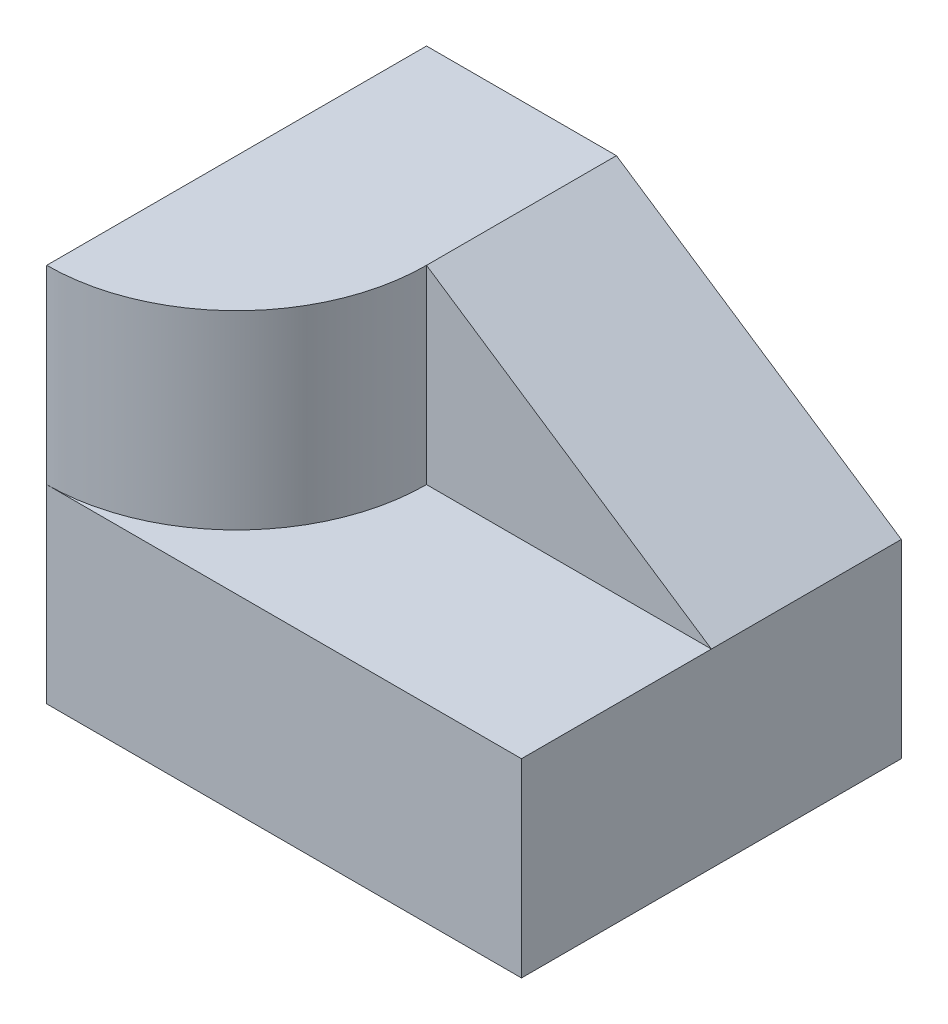
ISO-10303-21;
HEADER;
FILE_DESCRIPTION(('STEP AP214'),'2;1');
FILE_NAME('part.step','',(''),(''),'','','');
FILE_SCHEMA(('AUTOMOTIVE_DESIGN { 1 0 10303 214 1 1 1 1 }'));
ENDSEC;
DATA;
#1=APPLICATION_CONTEXT('core data for automotive mechanical design processes');
#2=APPLICATION_PROTOCOL_DEFINITION('international standard','automotive_design',2000,#1);
#3=PRODUCT_CONTEXT('',#1,'mechanical');
#4=PRODUCT('Part','Part','',(#3));
#5=PRODUCT_RELATED_PRODUCT_CATEGORY('part','',(#4));
#6=PRODUCT_DEFINITION_FORMATION('','',#4);
#7=PRODUCT_DEFINITION_CONTEXT('part definition',#1,'design');
#8=PRODUCT_DEFINITION('design','',#6,#7);
#9=PRODUCT_DEFINITION_SHAPE('','',#8);
#10=(LENGTH_UNIT() NAMED_UNIT(*) SI_UNIT(.MILLI.,.METRE.));
#11=(NAMED_UNIT(*) PLANE_ANGLE_UNIT() SI_UNIT($,.RADIAN.));
#12=(NAMED_UNIT(*) SI_UNIT($,.STERADIAN.) SOLID_ANGLE_UNIT());
#13=UNCERTAINTY_MEASURE_WITH_UNIT(LENGTH_MEASURE(1.E-05),#10,'distance_accuracy_value','');
#14=(GEOMETRIC_REPRESENTATION_CONTEXT(3) GLOBAL_UNCERTAINTY_ASSIGNED_CONTEXT((#13)) GLOBAL_UNIT_ASSIGNED_CONTEXT((#10,
#11,#12)) REPRESENTATION_CONTEXT('',''));
#15=CARTESIAN_POINT('',(0.,0.,0.));
#16=DIRECTION('',(0.,0.,1.));
#17=DIRECTION('',(1.,0.,0.));
#18=AXIS2_PLACEMENT_3D('',#15,#16,#17);
#19=CARTESIAN_POINT('',(-3.7855743992883,8.55901345742366,-0.575063618321078));
#20=DIRECTION('',(-1.,0.,0.));
#21=DIRECTION('',(0.,0.,1.));
#22=AXIS2_PLACEMENT_3D('',#19,#20,#21);
#23=PLANE('',#22);
#24=DIRECTION('',(0.,0.,-1.));
#25=VECTOR('',#24,1.);
#26=CARTESIAN_POINT('',(-3.7855743992883,6.55901345742366,-0.575063618321078));
#27=LINE('',#26,#25);
#28=CARTESIAN_POINT('',(-3.7855743992883,6.55901345742366,1.42493638167892));
#29=VERTEX_POINT('',#28);
#30=CARTESIAN_POINT('',(-3.7855743992883,6.55901345742366,-2.57506361832108));
#31=VERTEX_POINT('',#30);
#32=EDGE_CURVE('E103',#29,#31,#27,.T.);
#33=ORIENTED_EDGE('',*,*,#32,.F.);
#34=DIRECTION('',(0.,-1.,0.));
#35=VECTOR('',#34,1.);
#36=CARTESIAN_POINT('',(-3.7855743992883,8.55901345742366,1.42493638167892));
#37=LINE('',#36,#35);
#38=CARTESIAN_POINT('',(-3.7855743992883,8.55901345742366,1.42493638167892));
#39=VERTEX_POINT('',#38);
#40=EDGE_CURVE('E45',#39,#29,#37,.T.);
#41=ORIENTED_EDGE('',*,*,#40,.F.);
#42=DIRECTION('',(0.,-1.,0.));
#43=VECTOR('',#42,1.);
#44=CARTESIAN_POINT('',(-3.7855743992883,10.5590134574237,1.42493638167892));
#45=LINE('',#44,#43);
#46=CARTESIAN_POINT('',(-3.7855743992883,10.5590134574237,1.42493638167892));
#47=VERTEX_POINT('',#46);
#48=EDGE_CURVE('E129',#47,#39,#45,.T.);
#49=ORIENTED_EDGE('',*,*,#48,.F.);
#50=DIRECTION('',(0.,0.,-1.));
#51=VECTOR('',#50,1.);
#52=CARTESIAN_POINT('',(-3.7855743992883,10.5590134574237,-0.575063618321078));
#53=LINE('',#52,#51);
#54=CARTESIAN_POINT('',(-3.7855743992883,10.5590134574237,-2.57506361832108));
#55=VERTEX_POINT('',#54);
#56=EDGE_CURVE('E132',#47,#55,#53,.T.);
#57=ORIENTED_EDGE('',*,*,#56,.T.);
#58=DIRECTION('',(0.,-1.,0.));
#59=VECTOR('',#58,1.);
#60=CARTESIAN_POINT('',(-3.7855743992883,8.55901345742366,-2.57506361832108));
#61=LINE('',#60,#59);
#62=EDGE_CURVE('E89',#55,#31,#61,.T.);
#63=ORIENTED_EDGE('',*,*,#62,.T.);
#64=EDGE_LOOP('',(#33,#41,#49,#57,#63));
#65=FACE_BOUND('',#64,.T.);
#66=ADVANCED_FACE('F38',(#65),#23,.T.);
#67=CARTESIAN_POINT('',(-1.2855743992883,8.55901345742366,1.42493638167892));
#68=DIRECTION('',(0.,0.,-1.));
#69=DIRECTION('',(-1.,0.,0.));
#70=AXIS2_PLACEMENT_3D('',#67,#68,#69);
#71=PLANE('',#70);
#72=DIRECTION('',(1.,0.,0.));
#73=VECTOR('',#72,1.);
#74=CARTESIAN_POINT('',(-1.2855743992883,6.55901345742366,1.42493638167892));
#75=LINE('',#74,#73);
#76=CARTESIAN_POINT('',(1.2144256007117,6.55901345742366,1.42493638167892));
#77=VERTEX_POINT('',#76);
#78=EDGE_CURVE('E98',#29,#77,#75,.T.);
#79=ORIENTED_EDGE('',*,*,#78,.T.);
#80=DIRECTION('',(0.,-1.,0.));
#81=VECTOR('',#80,1.);
#82=CARTESIAN_POINT('',(1.2144256007117,8.55901345742366,1.42493638167892));
#83=LINE('',#82,#81);
#84=CARTESIAN_POINT('',(1.2144256007117,8.55901345742366,1.42493638167892));
#85=VERTEX_POINT('',#84);
#86=EDGE_CURVE('E88',#85,#77,#83,.T.);
#87=ORIENTED_EDGE('',*,*,#86,.F.);
#88=DIRECTION('',(1.,0.,0.));
#89=VECTOR('',#88,1.);
#90=CARTESIAN_POINT('',(-1.2855743992883,8.55901345742366,1.42493638167892));
#91=LINE('',#90,#89);
#92=EDGE_CURVE('E60',#39,#85,#91,.T.);
#93=ORIENTED_EDGE('',*,*,#92,.F.);
#94=ORIENTED_EDGE('',*,*,#40,.T.);
#95=EDGE_LOOP('',(#79,#87,#93,#94));
#96=FACE_BOUND('',#95,.T.);
#97=ADVANCED_FACE('F112',(#96),#71,.F.);
#98=CARTESIAN_POINT('',(1.2144256007117,8.55901345742366,-0.575063618321078));
#99=DIRECTION('',(-1.,0.,0.));
#100=DIRECTION('',(0.,0.,1.));
#101=AXIS2_PLACEMENT_3D('',#98,#99,#100);
#102=PLANE('',#101);
#103=DIRECTION('',(0.,-1.,0.));
#104=VECTOR('',#103,1.);
#105=CARTESIAN_POINT('',(1.2144256007117,8.55901345742366,-2.57506361832108));
#106=LINE('',#105,#104);
#107=CARTESIAN_POINT('',(1.2144256007117,8.55901345742366,-2.57506361832108));
#108=VERTEX_POINT('',#107);
#109=CARTESIAN_POINT('',(1.2144256007117,6.55901345742366,-2.57506361832108));
#110=VERTEX_POINT('',#109);
#111=EDGE_CURVE('E78',#108,#110,#106,.T.);
#112=ORIENTED_EDGE('',*,*,#111,.F.);
#113=DIRECTION('',(0.,0.,1.));
#114=VECTOR('',#113,1.);
#115=CARTESIAN_POINT('',(1.2144256007117,8.55901345742366,-4.57506361832108));
#116=LINE('',#115,#114);
#117=CARTESIAN_POINT('',(1.2144256007117,8.55901345742366,-0.575063618321078));
#118=VERTEX_POINT('',#117);
#119=EDGE_CURVE('E140',#108,#118,#116,.T.);
#120=ORIENTED_EDGE('',*,*,#119,.T.);
#121=DIRECTION('',(0.,0.,-1.));
#122=VECTOR('',#121,1.);
#123=CARTESIAN_POINT('',(1.2144256007117,8.55901345742366,-0.575063618321078));
#124=LINE('',#123,#122);
#125=EDGE_CURVE('E105',#85,#118,#124,.T.);
#126=ORIENTED_EDGE('',*,*,#125,.F.);
#127=ORIENTED_EDGE('',*,*,#86,.T.);
#128=DIRECTION('',(0.,0.,-1.));
#129=VECTOR('',#128,1.);
#130=CARTESIAN_POINT('',(1.2144256007117,6.55901345742366,-0.575063618321078));
#131=LINE('',#130,#129);
#132=EDGE_CURVE('E93',#77,#110,#131,.T.);
#133=ORIENTED_EDGE('',*,*,#132,.T.);
#134=EDGE_LOOP('',(#112,#120,#126,#127,#133));
#135=FACE_BOUND('',#134,.T.);
#136=ADVANCED_FACE('F94',(#135),#102,.F.);
#137=CARTESIAN_POINT('',(-1.2855743992883,8.55901345742366,-2.57506361832108));
#138=DIRECTION('',(0.,0.,-1.));
#139=DIRECTION('',(-1.,0.,0.));
#140=AXIS2_PLACEMENT_3D('',#137,#138,#139);
#141=PLANE('',#140);
#142=DIRECTION('',(-0.832050294337844,0.554700196225229,0.));
#143=VECTOR('',#142,1.);
#144=CARTESIAN_POINT('',(-0.516343630057528,9.71285961126981,-2.57506361832108));
#145=LINE('',#144,#143);
#146=CARTESIAN_POINT('',(-1.7855743992883,10.5590134574237,-2.57506361832108));
#147=VERTEX_POINT('',#146);
#148=EDGE_CURVE('E51',#108,#147,#145,.T.);
#149=ORIENTED_EDGE('',*,*,#148,.F.);
#150=ORIENTED_EDGE('',*,*,#111,.T.);
#151=DIRECTION('',(1.,0.,0.));
#152=VECTOR('',#151,1.);
#153=CARTESIAN_POINT('',(-1.2855743992883,6.55901345742366,-2.57506361832108));
#154=LINE('',#153,#152);
#155=EDGE_CURVE('E83',#31,#110,#154,.T.);
#156=ORIENTED_EDGE('',*,*,#155,.F.);
#157=ORIENTED_EDGE('',*,*,#62,.F.);
#158=DIRECTION('',(1.,0.,0.));
#159=VECTOR('',#158,1.);
#160=CARTESIAN_POINT('',(-1.2855743992883,10.5590134574237,-2.57506361832108));
#161=LINE('',#160,#159);
#162=EDGE_CURVE('E134',#55,#147,#161,.T.);
#163=ORIENTED_EDGE('',*,*,#162,.T.);
#164=EDGE_LOOP('',(#149,#150,#156,#157,#163));
#165=FACE_BOUND('',#164,.T.);
#166=ADVANCED_FACE('F80',(#165),#141,.T.);
#167=CARTESIAN_POINT('',(-1.2855743992883,8.55901345742366,-0.575063618321078));
#168=DIRECTION('',(0.,1.,0.));
#169=DIRECTION('',(0.,0.,1.));
#170=AXIS2_PLACEMENT_3D('',#167,#168,#169);
#171=PLANE('',#170);
#172=CARTESIAN_POINT('',(-3.7855743992883,8.55901345742366,-0.575063618321079));
#173=DIRECTION('',(0.,1.,0.));
#174=DIRECTION('',(0.,0.,1.));
#175=AXIS2_PLACEMENT_3D('',#172,#173,#174);
#176=CIRCLE('',#175,2.);
#177=CARTESIAN_POINT('',(-1.7855743992883,8.55901345742366,-0.575063618321078));
#178=VERTEX_POINT('',#177);
#179=EDGE_CURVE('E117',#39,#178,#176,.T.);
#180=ORIENTED_EDGE('',*,*,#179,.F.);
#181=ORIENTED_EDGE('',*,*,#92,.T.);
#182=ORIENTED_EDGE('',*,*,#125,.T.);
#183=DIRECTION('',(1.,0.,0.));
#184=VECTOR('',#183,1.);
#185=CARTESIAN_POINT('',(-1.2855743992883,8.55901345742366,-0.575063618321079));
#186=LINE('',#185,#184);
#187=EDGE_CURVE('E120',#178,#118,#186,.T.);
#188=ORIENTED_EDGE('',*,*,#187,.F.);
#189=EDGE_LOOP('',(#180,#181,#182,#188));
#190=FACE_BOUND('',#189,.T.);
#191=ADVANCED_FACE('F153',(#190),#171,.T.);
#192=CARTESIAN_POINT('',(-1.2855743992883,6.55901345742366,-0.575063618321078));
#193=DIRECTION('',(0.,1.,0.));
#194=DIRECTION('',(0.,0.,1.));
#195=AXIS2_PLACEMENT_3D('',#192,#193,#194);
#196=PLANE('',#195);
#197=ORIENTED_EDGE('',*,*,#78,.F.);
#198=ORIENTED_EDGE('',*,*,#32,.T.);
#199=ORIENTED_EDGE('',*,*,#155,.T.);
#200=ORIENTED_EDGE('',*,*,#132,.F.);
#201=EDGE_LOOP('',(#197,#198,#199,#200));
#202=FACE_BOUND('',#201,.T.);
#203=ADVANCED_FACE('F101',(#202),#196,.F.);
#204=CARTESIAN_POINT('',(-3.7855743992883,10.5590134574237,-0.575063618321079));
#205=DIRECTION('',(0.,-1.,0.));
#206=DIRECTION('',(0.,0.,-1.));
#207=AXIS2_PLACEMENT_3D('',#204,#205,#206);
#208=CYLINDRICAL_SURFACE('',#207,2.);
#209=ORIENTED_EDGE('',*,*,#48,.T.);
#210=ORIENTED_EDGE('',*,*,#179,.T.);
#211=DIRECTION('',(0.,-1.,0.));
#212=VECTOR('',#211,1.);
#213=CARTESIAN_POINT('',(-1.7855743992883,10.5590134574237,-0.575063618321078));
#214=LINE('',#213,#212);
#215=CARTESIAN_POINT('',(-1.7855743992883,10.5590134574237,-0.575063618321078));
#216=VERTEX_POINT('',#215);
#217=EDGE_CURVE('E126',#216,#178,#214,.T.);
#218=ORIENTED_EDGE('',*,*,#217,.F.);
#219=CARTESIAN_POINT('',(-3.7855743992883,10.5590134574237,-0.575063618321079));
#220=DIRECTION('',(0.,1.,0.));
#221=DIRECTION('',(0.,0.,1.));
#222=AXIS2_PLACEMENT_3D('',#219,#220,#221);
#223=CIRCLE('',#222,2.);
#224=EDGE_CURVE('E136',#216,#47,#223,.F.);
#225=ORIENTED_EDGE('',*,*,#224,.T.);
#226=EDGE_LOOP('',(#209,#210,#218,#225));
#227=FACE_BOUND('',#226,.T.);
#228=ADVANCED_FACE('F160',(#227),#208,.T.);
#229=CARTESIAN_POINT('',(-1.2855743992883,10.5590134574237,-0.575063618321079));
#230=DIRECTION('',(0.,0.,1.));
#231=DIRECTION('',(1.,0.,0.));
#232=AXIS2_PLACEMENT_3D('',#229,#230,#231);
#233=PLANE('',#232);
#234=DIRECTION('',(0.832050294337844,-0.554700196225229,0.));
#235=VECTOR('',#234,1.);
#236=CARTESIAN_POINT('',(-1.7855743992883,10.5590134574237,-0.575063618321078));
#237=LINE('',#236,#235);
#238=EDGE_CURVE('E142',#216,#118,#237,.T.);
#239=ORIENTED_EDGE('',*,*,#238,.F.);
#240=ORIENTED_EDGE('',*,*,#217,.T.);
#241=ORIENTED_EDGE('',*,*,#187,.T.);
#242=EDGE_LOOP('',(#239,#240,#241));
#243=FACE_BOUND('',#242,.T.);
#244=ADVANCED_FACE('F152',(#243),#233,.T.);
#245=CARTESIAN_POINT('',(-1.2855743992883,10.5590134574237,-0.575063618321078));
#246=DIRECTION('',(0.,1.,0.));
#247=DIRECTION('',(0.,0.,1.));
#248=AXIS2_PLACEMENT_3D('',#245,#246,#247);
#249=PLANE('',#248);
#250=DIRECTION('',(0.,0.,1.));
#251=VECTOR('',#250,1.);
#252=CARTESIAN_POINT('',(-1.7855743992883,10.5590134574237,-0.575063618321078));
#253=LINE('',#252,#251);
#254=EDGE_CURVE('E11',#147,#216,#253,.T.);
#255=ORIENTED_EDGE('',*,*,#254,.F.);
#256=ORIENTED_EDGE('',*,*,#162,.F.);
#257=ORIENTED_EDGE('',*,*,#56,.F.);
#258=ORIENTED_EDGE('',*,*,#224,.F.);
#259=EDGE_LOOP('',(#255,#256,#257,#258));
#260=FACE_BOUND('',#259,.T.);
#261=ADVANCED_FACE('F210',(#260),#249,.T.);
#262=CARTESIAN_POINT('',(-1.7855743992883,10.5590134574237,-4.57506361832108));
#263=DIRECTION('',(-0.554700196225229,-0.832050294337844,0.));
#264=DIRECTION('',(0.832050294337844,-0.554700196225229,0.));
#265=AXIS2_PLACEMENT_3D('',#262,#263,#264);
#266=PLANE('',#265);
#267=ORIENTED_EDGE('',*,*,#148,.T.);
#268=ORIENTED_EDGE('',*,*,#254,.T.);
#269=ORIENTED_EDGE('',*,*,#238,.T.);
#270=ORIENTED_EDGE('',*,*,#119,.F.);
#271=EDGE_LOOP('',(#267,#268,#269,#270));
#272=FACE_BOUND('',#271,.T.);
#273=ADVANCED_FACE('F146',(#272),#266,.F.);
#274=CLOSED_SHELL('',(#66,#97,#136,#166,#191,#203,#228,#244,#261,#273));
#275=MANIFOLD_SOLID_BREP('B2',#274);
#276=ADVANCED_BREP_SHAPE_REPRESENTATION('',(#18,#275),#14);
#277=SHAPE_DEFINITION_REPRESENTATION(#9,#276);
ENDSEC;
END-ISO-10303-21;
